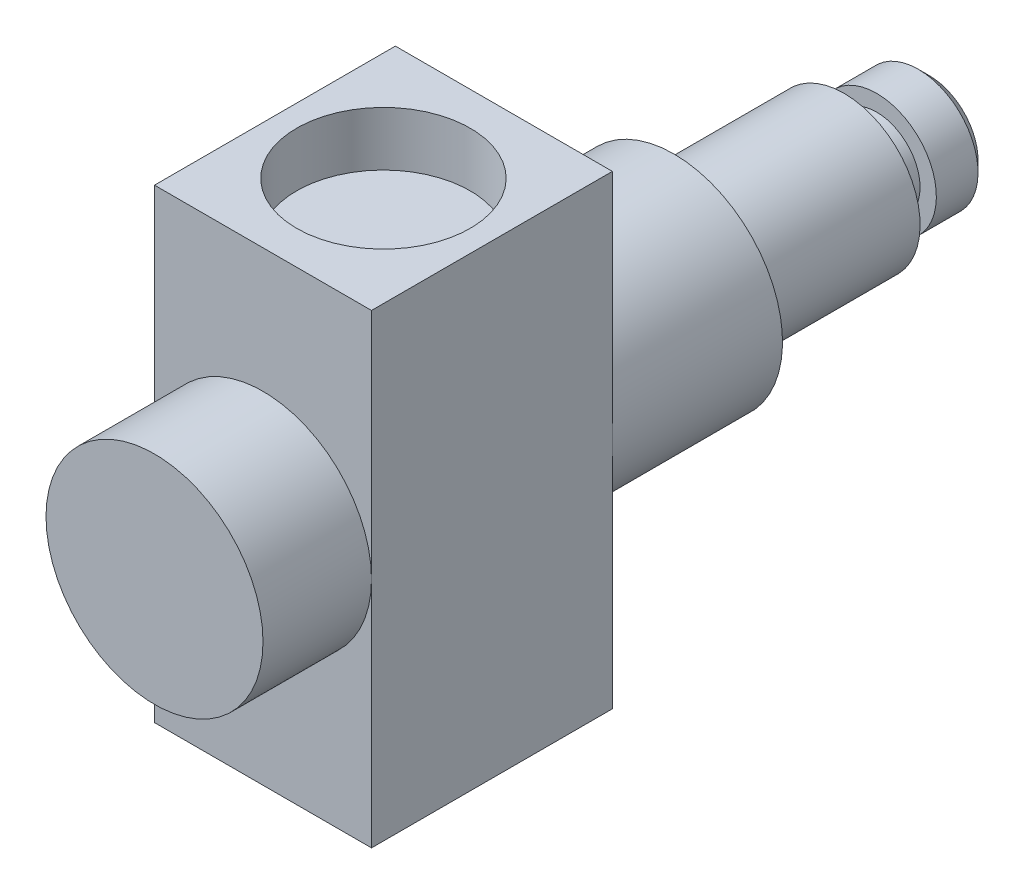
ISO-10303-21;
HEADER;
FILE_DESCRIPTION(('STEP AP214'),'2;1');
FILE_NAME('part.step','',(''),(''),'','','');
FILE_SCHEMA(('AUTOMOTIVE_DESIGN { 1 0 10303 214 1 1 1 1 }'));
ENDSEC;
DATA;
#1=APPLICATION_CONTEXT('core data for automotive mechanical design processes');
#2=APPLICATION_PROTOCOL_DEFINITION('international standard','automotive_design',2000,#1);
#3=PRODUCT_CONTEXT('',#1,'mechanical');
#4=PRODUCT('Part','Part','',(#3));
#5=PRODUCT_RELATED_PRODUCT_CATEGORY('part','',(#4));
#6=PRODUCT_DEFINITION_FORMATION('','',#4);
#7=PRODUCT_DEFINITION_CONTEXT('part definition',#1,'design');
#8=PRODUCT_DEFINITION('design','',#6,#7);
#9=PRODUCT_DEFINITION_SHAPE('','',#8);
#10=(LENGTH_UNIT() NAMED_UNIT(*) SI_UNIT(.MILLI.,.METRE.));
#11=(NAMED_UNIT(*) PLANE_ANGLE_UNIT() SI_UNIT($,.RADIAN.));
#12=(NAMED_UNIT(*) SI_UNIT($,.STERADIAN.) SOLID_ANGLE_UNIT());
#13=UNCERTAINTY_MEASURE_WITH_UNIT(LENGTH_MEASURE(1.E-05),#10,'distance_accuracy_value','');
#14=(GEOMETRIC_REPRESENTATION_CONTEXT(3) GLOBAL_UNCERTAINTY_ASSIGNED_CONTEXT((#13)) GLOBAL_UNIT_ASSIGNED_CONTEXT((#10,
#11,#12)) REPRESENTATION_CONTEXT('',''));
#15=CARTESIAN_POINT('',(0.,0.,0.));
#16=DIRECTION('',(0.,0.,1.));
#17=DIRECTION('',(1.,0.,0.));
#18=AXIS2_PLACEMENT_3D('',#15,#16,#17);
#19=CARTESIAN_POINT('',(20.,21.45,11.1));
#20=DIRECTION('',(0.,0.,-1.));
#21=DIRECTION('',(0.,1.,0.));
#22=AXIS2_PLACEMENT_3D('',#19,#20,#21);
#23=PLANE('',#22);
#24=CARTESIAN_POINT('',(10.,0.,11.1));
#25=DIRECTION('',(0.,0.,1.));
#26=DIRECTION('',(1.,0.,0.));
#27=AXIS2_PLACEMENT_3D('',#24,#25,#26);
#28=CIRCLE('',#27,10.);
#29=CARTESIAN_POINT('',(20.,0.,11.1));
#30=VERTEX_POINT('',#29);
#31=CARTESIAN_POINT('',(0.,0.,11.1));
#32=VERTEX_POINT('',#31);
#33=EDGE_CURVE('E49',#30,#32,#28,.T.);
#34=ORIENTED_EDGE('',*,*,#33,.F.);
#35=DIRECTION('',(0.,-1.,0.));
#36=VECTOR('',#35,1.);
#37=CARTESIAN_POINT('',(20.,21.45,11.1));
#38=LINE('',#37,#36);
#39=CARTESIAN_POINT('',(20.,21.45,11.1));
#40=VERTEX_POINT('',#39);
#41=EDGE_CURVE('E93',#40,#30,#38,.T.);
#42=ORIENTED_EDGE('',*,*,#41,.F.);
#43=DIRECTION('',(-1.,0.,0.));
#44=VECTOR('',#43,1.);
#45=CARTESIAN_POINT('',(20.,21.45,11.1));
#46=LINE('',#45,#44);
#47=CARTESIAN_POINT('',(0.,21.45,11.1));
#48=VERTEX_POINT('',#47);
#49=EDGE_CURVE('E163',#40,#48,#46,.T.);
#50=ORIENTED_EDGE('',*,*,#49,.T.);
#51=DIRECTION('',(0.,-1.,0.));
#52=VECTOR('',#51,1.);
#53=CARTESIAN_POINT('',(0.,21.45,11.1));
#54=LINE('',#53,#52);
#55=EDGE_CURVE('E112',#48,#32,#54,.T.);
#56=ORIENTED_EDGE('',*,*,#55,.T.);
#57=EDGE_LOOP('',(#34,#42,#50,#56));
#58=FACE_BOUND('',#57,.T.);
#59=ADVANCED_FACE('F38',(#58),#23,.F.);
#60=CARTESIAN_POINT('',(10.,0.,-26.78));
#61=DIRECTION('',(0.,0.,-1.));
#62=DIRECTION('',(0.,1.,0.));
#63=AXIS2_PLACEMENT_3D('',#60,#61,#62);
#64=CYLINDRICAL_SURFACE('',#63,7.);
#65=CARTESIAN_POINT('',(10.,0.,-26.78));
#66=DIRECTION('',(0.,0.,-1.));
#67=DIRECTION('',(0.,1.,0.));
#68=AXIS2_PLACEMENT_3D('',#65,#66,#67);
#69=CIRCLE('',#68,7.);
#70=CARTESIAN_POINT('',(10.,7.,-26.78));
#71=VERTEX_POINT('',#70);
#72=EDGE_CURVE('E202',#71,#71,#69,.T.);
#73=ORIENTED_EDGE('',*,*,#72,.T.);
#74=EDGE_LOOP('',(#73));
#75=FACE_BOUND('',#74,.T.);
#76=CARTESIAN_POINT('',(10.,0.,-42.46));
#77=DIRECTION('',(0.,0.,-1.));
#78=DIRECTION('',(0.,1.,0.));
#79=AXIS2_PLACEMENT_3D('',#76,#77,#78);
#80=CIRCLE('',#79,7.);
#81=CARTESIAN_POINT('',(10.,7.00000000000001,-42.46));
#82=VERTEX_POINT('',#81);
#83=EDGE_CURVE('E206',#82,#82,#80,.T.);
#84=ORIENTED_EDGE('',*,*,#83,.F.);
#85=EDGE_LOOP('',(#84));
#86=FACE_BOUND('',#85,.T.);
#87=ADVANCED_FACE('F132',(#75,#86),#64,.T.);
#88=CARTESIAN_POINT('',(10.,0.,-50.3));
#89=DIRECTION('',(0.,0.,1.));
#90=DIRECTION('',(0.,-1.,0.));
#91=AXIS2_PLACEMENT_3D('',#88,#89,#90);
#92=CYLINDRICAL_SURFACE('',#91,10.);
#93=CARTESIAN_POINT('',(10.,0.,-11.1));
#94=DIRECTION('',(0.,0.,-1.));
#95=DIRECTION('',(0.,1.,0.));
#96=AXIS2_PLACEMENT_3D('',#93,#94,#95);
#97=CIRCLE('',#96,10.);
#98=CARTESIAN_POINT('',(20.,0.,-11.1));
#99=VERTEX_POINT('',#98);
#100=CARTESIAN_POINT('',(0.,0.,-11.1));
#101=VERTEX_POINT('',#100);
#102=EDGE_CURVE('E190',#99,#101,#97,.T.);
#103=ORIENTED_EDGE('',*,*,#102,.T.);
#104=EDGE_CURVE('E62',#101,#99,#97,.T.);
#105=ORIENTED_EDGE('',*,*,#104,.T.);
#106=EDGE_LOOP('',(#103,#105));
#107=FACE_BOUND('',#106,.T.);
#108=CARTESIAN_POINT('',(10.,0.,-26.78));
#109=DIRECTION('',(0.,0.,-1.));
#110=DIRECTION('',(0.,1.,0.));
#111=AXIS2_PLACEMENT_3D('',#108,#109,#110);
#112=CIRCLE('',#111,10.);
#113=CARTESIAN_POINT('',(10.,10.,-26.78));
#114=VERTEX_POINT('',#113);
#115=EDGE_CURVE('E196',#114,#114,#112,.T.);
#116=ORIENTED_EDGE('',*,*,#115,.F.);
#117=EDGE_LOOP('',(#116));
#118=FACE_BOUND('',#117,.T.);
#119=ADVANCED_FACE('F137',(#107,#118),#92,.T.);
#120=CARTESIAN_POINT('',(20.,21.45,-11.1));
#121=DIRECTION('',(0.,0.,1.));
#122=DIRECTION('',(0.,-1.,0.));
#123=AXIS2_PLACEMENT_3D('',#120,#121,#122);
#124=PLANE('',#123);
#125=ORIENTED_EDGE('',*,*,#102,.F.);
#126=DIRECTION('',(0.,1.,0.));
#127=VECTOR('',#126,1.);
#128=CARTESIAN_POINT('',(20.,21.45,-11.1));
#129=LINE('',#128,#127);
#130=CARTESIAN_POINT('',(20.,-21.45,-11.1));
#131=VERTEX_POINT('',#130);
#132=EDGE_CURVE('E392',#131,#99,#129,.T.);
#133=ORIENTED_EDGE('',*,*,#132,.F.);
#134=DIRECTION('',(-1.,0.,0.));
#135=VECTOR('',#134,1.);
#136=CARTESIAN_POINT('',(20.,-21.45,-11.1));
#137=LINE('',#136,#135);
#138=CARTESIAN_POINT('',(0.,-21.45,-11.1));
#139=VERTEX_POINT('',#138);
#140=EDGE_CURVE('E180',#131,#139,#137,.T.);
#141=ORIENTED_EDGE('',*,*,#140,.T.);
#142=DIRECTION('',(0.,1.,0.));
#143=VECTOR('',#142,1.);
#144=CARTESIAN_POINT('',(0.,21.45,-11.1));
#145=LINE('',#144,#143);
#146=EDGE_CURVE('E168',#139,#101,#145,.T.);
#147=ORIENTED_EDGE('',*,*,#146,.T.);
#148=EDGE_LOOP('',(#125,#133,#141,#147));
#149=FACE_BOUND('',#148,.T.);
#150=ADVANCED_FACE('F155',(#149),#124,.F.);
#151=ORIENTED_EDGE('',*,*,#104,.F.);
#152=CARTESIAN_POINT('',(0.,21.45,-11.1));
#153=VERTEX_POINT('',#152);
#154=EDGE_CURVE('E394',#101,#153,#145,.T.);
#155=ORIENTED_EDGE('',*,*,#154,.T.);
#156=DIRECTION('',(-1.,0.,0.));
#157=VECTOR('',#156,1.);
#158=CARTESIAN_POINT('',(20.,21.45,-11.1));
#159=LINE('',#158,#157);
#160=CARTESIAN_POINT('',(20.,21.45,-11.1));
#161=VERTEX_POINT('',#160);
#162=EDGE_CURVE('E165',#161,#153,#159,.T.);
#163=ORIENTED_EDGE('',*,*,#162,.F.);
#164=EDGE_CURVE('E176',#99,#161,#129,.T.);
#165=ORIENTED_EDGE('',*,*,#164,.F.);
#166=EDGE_LOOP('',(#151,#155,#163,#165));
#167=FACE_BOUND('',#166,.T.);
#168=ADVANCED_FACE('F150',(#167),#124,.F.);
#169=CARTESIAN_POINT('',(20.,21.45,11.1));
#170=DIRECTION('',(0.,-1.,0.));
#171=DIRECTION('',(0.,0.,-1.));
#172=AXIS2_PLACEMENT_3D('',#169,#170,#171);
#173=PLANE('',#172);
#174=CARTESIAN_POINT('',(10.,21.45,0.));
#175=DIRECTION('',(0.,1.,0.));
#176=DIRECTION('',(0.,0.,1.));
#177=AXIS2_PLACEMENT_3D('',#174,#175,#176);
#178=CIRCLE('',#177,8.);
#179=CARTESIAN_POINT('',(10.,21.45,8.));
#180=VERTEX_POINT('',#179);
#181=EDGE_CURVE('E159',#180,#180,#178,.T.);
#182=ORIENTED_EDGE('',*,*,#181,.F.);
#183=EDGE_LOOP('',(#182));
#184=FACE_BOUND('',#183,.T.);
#185=DIRECTION('',(0.,0.,1.));
#186=VECTOR('',#185,1.);
#187=CARTESIAN_POINT('',(0.,21.45,11.1));
#188=LINE('',#187,#186);
#189=EDGE_CURVE('E162',#153,#48,#188,.T.);
#190=ORIENTED_EDGE('',*,*,#189,.T.);
#191=ORIENTED_EDGE('',*,*,#49,.F.);
#192=DIRECTION('',(0.,0.,1.));
#193=VECTOR('',#192,1.);
#194=CARTESIAN_POINT('',(20.,21.45,11.1));
#195=LINE('',#194,#193);
#196=EDGE_CURVE('E98',#161,#40,#195,.T.);
#197=ORIENTED_EDGE('',*,*,#196,.F.);
#198=ORIENTED_EDGE('',*,*,#162,.T.);
#199=EDGE_LOOP('',(#190,#191,#197,#198));
#200=FACE_BOUND('',#199,.T.);
#201=ADVANCED_FACE('F144',(#184,#200),#173,.F.);
#202=EDGE_CURVE('E11',#32,#30,#28,.T.);
#203=ORIENTED_EDGE('',*,*,#202,.F.);
#204=CARTESIAN_POINT('',(0.,-21.45,11.1));
#205=VERTEX_POINT('',#204);
#206=EDGE_CURVE('E167',#32,#205,#54,.T.);
#207=ORIENTED_EDGE('',*,*,#206,.T.);
#208=DIRECTION('',(-1.,0.,0.));
#209=VECTOR('',#208,1.);
#210=CARTESIAN_POINT('',(20.,-21.45,11.1));
#211=LINE('',#210,#209);
#212=CARTESIAN_POINT('',(20.,-21.45,11.1));
#213=VERTEX_POINT('',#212);
#214=EDGE_CURVE('E107',#213,#205,#211,.T.);
#215=ORIENTED_EDGE('',*,*,#214,.F.);
#216=EDGE_CURVE('E95',#30,#213,#38,.T.);
#217=ORIENTED_EDGE('',*,*,#216,.F.);
#218=EDGE_LOOP('',(#203,#207,#215,#217));
#219=FACE_BOUND('',#218,.T.);
#220=ADVANCED_FACE('F105',(#219),#23,.F.);
#221=CARTESIAN_POINT('',(20.,-21.45,11.1));
#222=DIRECTION('',(0.,1.,0.));
#223=DIRECTION('',(0.,0.,1.));
#224=AXIS2_PLACEMENT_3D('',#221,#222,#223);
#225=PLANE('',#224);
#226=CARTESIAN_POINT('',(10.,-21.45,0.));
#227=DIRECTION('',(0.,-1.,0.));
#228=DIRECTION('',(0.,0.,-1.));
#229=AXIS2_PLACEMENT_3D('',#226,#227,#228);
#230=CIRCLE('',#229,8.);
#231=CARTESIAN_POINT('',(10.,-21.45,-8.));
#232=VERTEX_POINT('',#231);
#233=EDGE_CURVE('E195',#232,#232,#230,.T.);
#234=ORIENTED_EDGE('',*,*,#233,.F.);
#235=EDGE_LOOP('',(#234));
#236=FACE_BOUND('',#235,.T.);
#237=DIRECTION('',(0.,0.,-1.));
#238=VECTOR('',#237,1.);
#239=CARTESIAN_POINT('',(0.,-21.45,11.1));
#240=LINE('',#239,#238);
#241=EDGE_CURVE('E174',#205,#139,#240,.T.);
#242=ORIENTED_EDGE('',*,*,#241,.T.);
#243=ORIENTED_EDGE('',*,*,#140,.F.);
#244=DIRECTION('',(0.,0.,-1.));
#245=VECTOR('',#244,1.);
#246=CARTESIAN_POINT('',(20.,-21.45,11.1));
#247=LINE('',#246,#245);
#248=EDGE_CURVE('E103',#213,#131,#247,.T.);
#249=ORIENTED_EDGE('',*,*,#248,.F.);
#250=ORIENTED_EDGE('',*,*,#214,.T.);
#251=EDGE_LOOP('',(#242,#243,#249,#250));
#252=FACE_BOUND('',#251,.T.);
#253=ADVANCED_FACE('F143',(#236,#252),#225,.F.);
#254=CARTESIAN_POINT('',(20.,0.,0.));
#255=DIRECTION('',(1.,0.,0.));
#256=DIRECTION('',(0.,0.,-1.));
#257=AXIS2_PLACEMENT_3D('',#254,#255,#256);
#258=PLANE('',#257);
#259=ORIENTED_EDGE('',*,*,#132,.T.);
#260=ORIENTED_EDGE('',*,*,#164,.T.);
#261=ORIENTED_EDGE('',*,*,#196,.T.);
#262=ORIENTED_EDGE('',*,*,#41,.T.);
#263=ORIENTED_EDGE('',*,*,#216,.T.);
#264=ORIENTED_EDGE('',*,*,#248,.T.);
#265=EDGE_LOOP('',(#259,#260,#261,#262,#263,#264));
#266=FACE_BOUND('',#265,.T.);
#267=ADVANCED_FACE('F94',(#266),#258,.T.);
#268=CARTESIAN_POINT('',(0.,0.,0.));
#269=DIRECTION('',(1.,0.,0.));
#270=DIRECTION('',(0.,0.,-1.));
#271=AXIS2_PLACEMENT_3D('',#268,#269,#270);
#272=PLANE('',#271);
#273=ORIENTED_EDGE('',*,*,#146,.F.);
#274=ORIENTED_EDGE('',*,*,#241,.F.);
#275=ORIENTED_EDGE('',*,*,#206,.F.);
#276=ORIENTED_EDGE('',*,*,#55,.F.);
#277=ORIENTED_EDGE('',*,*,#189,.F.);
#278=ORIENTED_EDGE('',*,*,#154,.F.);
#279=EDGE_LOOP('',(#273,#274,#275,#276,#277,#278));
#280=FACE_BOUND('',#279,.T.);
#281=ADVANCED_FACE('F172',(#280),#272,.F.);
#282=CARTESIAN_POINT('',(10.,16.45,0.));
#283=DIRECTION('',(0.,1.,0.));
#284=DIRECTION('',(0.,0.,1.));
#285=AXIS2_PLACEMENT_3D('',#282,#283,#284);
#286=CYLINDRICAL_SURFACE('',#285,8.);
#287=CARTESIAN_POINT('',(10.,16.45,0.));
#288=DIRECTION('',(0.,1.,0.));
#289=DIRECTION('',(0.,0.,1.));
#290=AXIS2_PLACEMENT_3D('',#287,#288,#289);
#291=CIRCLE('',#290,8.);
#292=CARTESIAN_POINT('',(10.,16.45,8.));
#293=VERTEX_POINT('',#292);
#294=EDGE_CURVE('E395',#293,#293,#291,.T.);
#295=ORIENTED_EDGE('',*,*,#294,.F.);
#296=EDGE_LOOP('',(#295));
#297=FACE_BOUND('',#296,.T.);
#298=ORIENTED_EDGE('',*,*,#181,.T.);
#299=EDGE_LOOP('',(#298));
#300=FACE_BOUND('',#299,.T.);
#301=ADVANCED_FACE('F260',(#297,#300),#286,.F.);
#302=CARTESIAN_POINT('',(10.,16.45,0.));
#303=DIRECTION('',(0.,1.,0.));
#304=DIRECTION('',(0.,0.,1.));
#305=AXIS2_PLACEMENT_3D('',#302,#303,#304);
#306=PLANE('',#305);
#307=ORIENTED_EDGE('',*,*,#294,.T.);
#308=EDGE_LOOP('',(#307));
#309=FACE_BOUND('',#308,.T.);
#310=ADVANCED_FACE('F256',(#309),#306,.T.);
#311=CARTESIAN_POINT('',(10.,-16.45,0.));
#312=DIRECTION('',(0.,-1.,0.));
#313=DIRECTION('',(0.,0.,-1.));
#314=AXIS2_PLACEMENT_3D('',#311,#312,#313);
#315=CYLINDRICAL_SURFACE('',#314,8.);
#316=CARTESIAN_POINT('',(10.,-16.45,0.));
#317=DIRECTION('',(0.,-1.,0.));
#318=DIRECTION('',(0.,0.,-1.));
#319=AXIS2_PLACEMENT_3D('',#316,#317,#318);
#320=CIRCLE('',#319,8.);
#321=CARTESIAN_POINT('',(10.,-16.45,-8.));
#322=VERTEX_POINT('',#321);
#323=EDGE_CURVE('E199',#322,#322,#320,.T.);
#324=ORIENTED_EDGE('',*,*,#323,.F.);
#325=EDGE_LOOP('',(#324));
#326=FACE_BOUND('',#325,.T.);
#327=ORIENTED_EDGE('',*,*,#233,.T.);
#328=EDGE_LOOP('',(#327));
#329=FACE_BOUND('',#328,.T.);
#330=ADVANCED_FACE('F252',(#326,#329),#315,.F.);
#331=CARTESIAN_POINT('',(10.,-16.45,0.));
#332=DIRECTION('',(0.,-1.,0.));
#333=DIRECTION('',(0.,0.,-1.));
#334=AXIS2_PLACEMENT_3D('',#331,#332,#333);
#335=PLANE('',#334);
#336=ORIENTED_EDGE('',*,*,#323,.T.);
#337=EDGE_LOOP('',(#336));
#338=FACE_BOUND('',#337,.T.);
#339=ADVANCED_FACE('F242',(#338),#335,.T.);
#340=CARTESIAN_POINT('',(10.,0.,-26.78));
#341=DIRECTION('',(0.,0.,-1.));
#342=DIRECTION('',(0.,1.,0.));
#343=AXIS2_PLACEMENT_3D('',#340,#341,#342);
#344=PLANE('',#343);
#345=ORIENTED_EDGE('',*,*,#72,.F.);
#346=EDGE_LOOP('',(#345));
#347=FACE_BOUND('',#346,.T.);
#348=ORIENTED_EDGE('',*,*,#115,.T.);
#349=EDGE_LOOP('',(#348));
#350=FACE_BOUND('',#349,.T.);
#351=ADVANCED_FACE('F233',(#347,#350),#344,.T.);
#352=CARTESIAN_POINT('',(10.,0.,-42.46));
#353=DIRECTION('',(0.,0.,-1.));
#354=DIRECTION('',(0.,1.,0.));
#355=AXIS2_PLACEMENT_3D('',#352,#353,#354);
#356=PLANE('',#355);
#357=ORIENTED_EDGE('',*,*,#83,.T.);
#358=EDGE_LOOP('',(#357));
#359=FACE_BOUND('',#358,.T.);
#360=CARTESIAN_POINT('',(10.,0.,-42.46));
#361=DIRECTION('',(0.,0.,-1.));
#362=DIRECTION('',(0.,1.,0.));
#363=AXIS2_PLACEMENT_3D('',#360,#361,#362);
#364=CIRCLE('',#363,4.);
#365=CARTESIAN_POINT('',(10.,4.00000000000001,-42.46));
#366=VERTEX_POINT('',#365);
#367=EDGE_CURVE('E215',#366,#366,#364,.T.);
#368=ORIENTED_EDGE('',*,*,#367,.F.);
#369=EDGE_LOOP('',(#368));
#370=FACE_BOUND('',#369,.T.);
#371=ADVANCED_FACE('F231',(#359,#370),#356,.T.);
#372=CARTESIAN_POINT('',(10.,0.,-45.46));
#373=DIRECTION('',(0.,0.,-1.));
#374=DIRECTION('',(0.,1.,0.));
#375=AXIS2_PLACEMENT_3D('',#372,#373,#374);
#376=PLANE('',#375);
#377=CARTESIAN_POINT('',(10.,0.,-45.46));
#378=DIRECTION('',(0.,0.,-1.));
#379=DIRECTION('',(0.,1.,0.));
#380=AXIS2_PLACEMENT_3D('',#377,#378,#379);
#381=CIRCLE('',#380,5.5);
#382=CARTESIAN_POINT('',(10.,5.50000000000001,-45.46));
#383=VERTEX_POINT('',#382);
#384=EDGE_CURVE('E211',#383,#383,#381,.T.);
#385=ORIENTED_EDGE('',*,*,#384,.F.);
#386=EDGE_LOOP('',(#385));
#387=FACE_BOUND('',#386,.T.);
#388=CARTESIAN_POINT('',(10.,0.,-45.46));
#389=DIRECTION('',(0.,0.,-1.));
#390=DIRECTION('',(0.,1.,0.));
#391=AXIS2_PLACEMENT_3D('',#388,#389,#390);
#392=CIRCLE('',#391,4.);
#393=CARTESIAN_POINT('',(10.,4.00000000000001,-45.46));
#394=VERTEX_POINT('',#393);
#395=EDGE_CURVE('E214',#394,#394,#392,.T.);
#396=ORIENTED_EDGE('',*,*,#395,.T.);
#397=EDGE_LOOP('',(#396));
#398=FACE_BOUND('',#397,.T.);
#399=ADVANCED_FACE('F223',(#387,#398),#376,.F.);
#400=CARTESIAN_POINT('',(10.,0.,-45.46));
#401=DIRECTION('',(0.,0.,1.));
#402=DIRECTION('',(0.,-1.,0.));
#403=AXIS2_PLACEMENT_3D('',#400,#401,#402);
#404=CYLINDRICAL_SURFACE('',#403,4.);
#405=ORIENTED_EDGE('',*,*,#395,.F.);
#406=EDGE_LOOP('',(#405));
#407=FACE_BOUND('',#406,.T.);
#408=ORIENTED_EDGE('',*,*,#367,.T.);
#409=EDGE_LOOP('',(#408));
#410=FACE_BOUND('',#409,.T.);
#411=ADVANCED_FACE('F225',(#407,#410),#404,.T.);
#412=CARTESIAN_POINT('',(10.,0.,-50.3));
#413=DIRECTION('',(0.,0.,-1.));
#414=DIRECTION('',(0.,1.,0.));
#415=AXIS2_PLACEMENT_3D('',#412,#413,#414);
#416=PLANE('',#415);
#417=CARTESIAN_POINT('',(10.,0.,-50.3));
#418=DIRECTION('',(0.,0.,-1.));
#419=DIRECTION('',(0.,1.,0.));
#420=AXIS2_PLACEMENT_3D('',#417,#418,#419);
#421=CIRCLE('',#420,4.49999999999998);
#422=CARTESIAN_POINT('',(10.,4.49999999999998,-50.3));
#423=VERTEX_POINT('',#422);
#424=EDGE_CURVE('E184',#423,#423,#421,.T.);
#425=ORIENTED_EDGE('',*,*,#424,.T.);
#426=EDGE_LOOP('',(#425));
#427=FACE_BOUND('',#426,.T.);
#428=ADVANCED_FACE('F228',(#427),#416,.T.);
#429=CARTESIAN_POINT('',(10.,0.,-50.3));
#430=DIRECTION('',(0.,0.,1.));
#431=DIRECTION('',(0.,-1.,0.));
#432=AXIS2_PLACEMENT_3D('',#429,#430,#431);
#433=CONICAL_SURFACE('',#432,4.49999999999998,0.785398163397445);
#434=CARTESIAN_POINT('',(10.,0.,-49.3));
#435=DIRECTION('',(0.,0.,-1.));
#436=DIRECTION('',(0.,1.,0.));
#437=AXIS2_PLACEMENT_3D('',#434,#435,#436);
#438=CIRCLE('',#437,5.5);
#439=CARTESIAN_POINT('',(10.,5.50000000000001,-49.3));
#440=VERTEX_POINT('',#439);
#441=EDGE_CURVE('E43',#440,#440,#438,.F.);
#442=ORIENTED_EDGE('',*,*,#441,.F.);
#443=EDGE_LOOP('',(#442));
#444=FACE_BOUND('',#443,.T.);
#445=ORIENTED_EDGE('',*,*,#424,.F.);
#446=EDGE_LOOP('',(#445));
#447=FACE_BOUND('',#446,.T.);
#448=ADVANCED_FACE('F41',(#444,#447),#433,.T.);
#449=CARTESIAN_POINT('',(10.,0.,-42.46));
#450=DIRECTION('',(0.,0.,-1.));
#451=DIRECTION('',(0.,1.,0.));
#452=AXIS2_PLACEMENT_3D('',#449,#450,#451);
#453=CYLINDRICAL_SURFACE('',#452,5.5);
#454=ORIENTED_EDGE('',*,*,#384,.T.);
#455=EDGE_LOOP('',(#454));
#456=FACE_BOUND('',#455,.T.);
#457=ORIENTED_EDGE('',*,*,#441,.T.);
#458=EDGE_LOOP('',(#457));
#459=FACE_BOUND('',#458,.T.);
#460=ADVANCED_FACE('F118',(#456,#459),#453,.T.);
#461=CARTESIAN_POINT('',(10.,0.,21.1));
#462=DIRECTION('',(0.,0.,-1.));
#463=DIRECTION('',(-1.,0.,0.));
#464=AXIS2_PLACEMENT_3D('',#461,#462,#463);
#465=CYLINDRICAL_SURFACE('',#464,10.);
#466=CARTESIAN_POINT('',(10.,0.,21.1));
#467=DIRECTION('',(0.,0.,1.));
#468=DIRECTION('',(1.,0.,0.));
#469=AXIS2_PLACEMENT_3D('',#466,#467,#468);
#470=CIRCLE('',#469,10.);
#471=CARTESIAN_POINT('',(20.,0.,21.1));
#472=VERTEX_POINT('',#471);
#473=EDGE_CURVE('E114',#472,#472,#470,.T.);
#474=ORIENTED_EDGE('',*,*,#473,.F.);
#475=EDGE_LOOP('',(#474));
#476=FACE_BOUND('',#475,.T.);
#477=ORIENTED_EDGE('',*,*,#33,.T.);
#478=ORIENTED_EDGE('',*,*,#202,.T.);
#479=EDGE_LOOP('',(#477,#478));
#480=FACE_BOUND('',#479,.T.);
#481=ADVANCED_FACE('F115',(#476,#480),#465,.T.);
#482=CARTESIAN_POINT('',(10.,0.,21.1));
#483=DIRECTION('',(0.,0.,1.));
#484=DIRECTION('',(1.,0.,0.));
#485=AXIS2_PLACEMENT_3D('',#482,#483,#484);
#486=PLANE('',#485);
#487=ORIENTED_EDGE('',*,*,#473,.T.);
#488=EDGE_LOOP('',(#487));
#489=FACE_BOUND('',#488,.T.);
#490=ADVANCED_FACE('F117',(#489),#486,.T.);
#491=CLOSED_SHELL('',(#59,#87,#119,#150,#168,#201,#220,#253,#267,#281,#301,#310,#330,#339,#351,
#371,#399,#411,#428,#448,#460,#481,#490));
#492=MANIFOLD_SOLID_BREP('B2',#491);
#493=ADVANCED_BREP_SHAPE_REPRESENTATION('',(#18,#492),#14);
#494=SHAPE_DEFINITION_REPRESENTATION(#9,#493);
ENDSEC;
END-ISO-10303-21;
